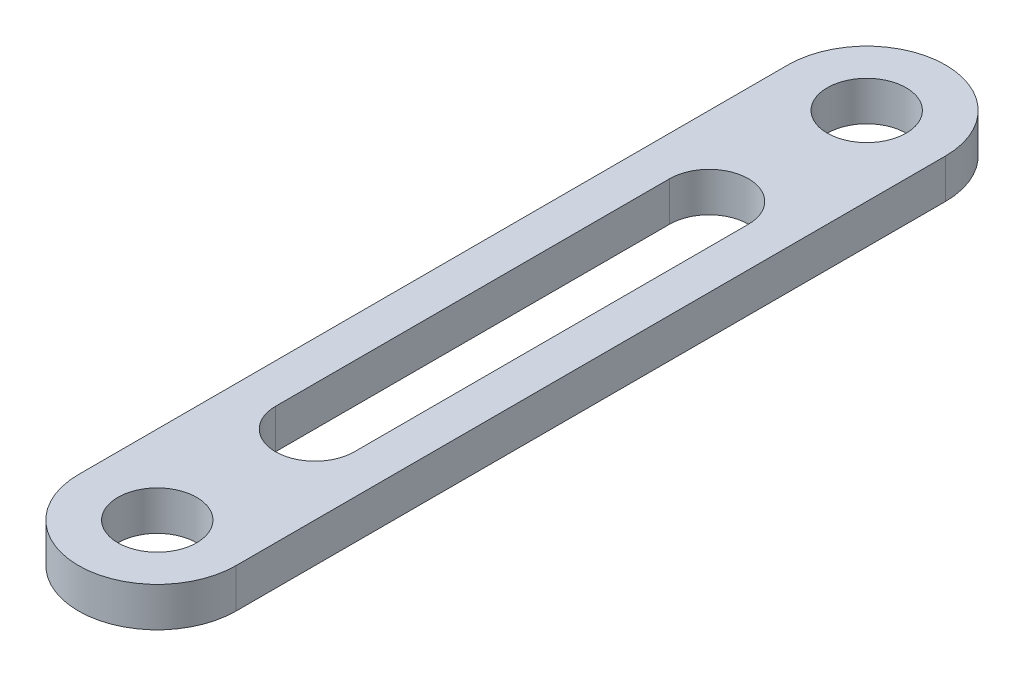
ISO-10303-21;
HEADER;
FILE_DESCRIPTION(('STEP AP214'),'2;1');
FILE_NAME('part.step','',(''),(''),'','','');
FILE_SCHEMA(('AUTOMOTIVE_DESIGN { 1 0 10303 214 1 1 1 1 }'));
ENDSEC;
DATA;
#1=APPLICATION_CONTEXT('core data for automotive mechanical design processes');
#2=APPLICATION_PROTOCOL_DEFINITION('international standard','automotive_design',2000,#1);
#3=PRODUCT_CONTEXT('',#1,'mechanical');
#4=PRODUCT('Part','Part','',(#3));
#5=PRODUCT_RELATED_PRODUCT_CATEGORY('part','',(#4));
#6=PRODUCT_DEFINITION_FORMATION('','',#4);
#7=PRODUCT_DEFINITION_CONTEXT('part definition',#1,'design');
#8=PRODUCT_DEFINITION('design','',#6,#7);
#9=PRODUCT_DEFINITION_SHAPE('','',#8);
#10=(LENGTH_UNIT() NAMED_UNIT(*) SI_UNIT(.MILLI.,.METRE.));
#11=(NAMED_UNIT(*) PLANE_ANGLE_UNIT() SI_UNIT($,.RADIAN.));
#12=(NAMED_UNIT(*) SI_UNIT($,.STERADIAN.) SOLID_ANGLE_UNIT());
#13=UNCERTAINTY_MEASURE_WITH_UNIT(LENGTH_MEASURE(1.E-05),#10,'distance_accuracy_value','');
#14=(GEOMETRIC_REPRESENTATION_CONTEXT(3) GLOBAL_UNCERTAINTY_ASSIGNED_CONTEXT((#13)) GLOBAL_UNIT_ASSIGNED_CONTEXT((#10,
#11,#12)) REPRESENTATION_CONTEXT('',''));
#15=CARTESIAN_POINT('',(0.,0.,0.));
#16=DIRECTION('',(0.,0.,1.));
#17=DIRECTION('',(1.,0.,0.));
#18=AXIS2_PLACEMENT_3D('',#15,#16,#17);
#19=CARTESIAN_POINT('',(0.,5.,0.));
#20=DIRECTION('',(0.,1.,0.));
#21=DIRECTION('',(0.,0.,1.));
#22=AXIS2_PLACEMENT_3D('',#19,#20,#21);
#23=PLANE('',#22);
#24=CARTESIAN_POINT('',(0.,5.,0.));
#25=DIRECTION('',(0.,1.,0.));
#26=DIRECTION('',(0.,0.,1.));
#27=AXIS2_PLACEMENT_3D('',#24,#25,#26);
#28=CIRCLE('',#27,5.);
#29=CARTESIAN_POINT('',(0.,5.,5.));
#30=VERTEX_POINT('',#29);
#31=EDGE_CURVE('E127',#30,#30,#28,.T.);
#32=ORIENTED_EDGE('',*,*,#31,.F.);
#33=EDGE_LOOP('',(#32));
#34=FACE_BOUND('',#33,.T.);
#35=CARTESIAN_POINT('',(0.,5.,0.));
#36=DIRECTION('',(0.,1.,0.));
#37=DIRECTION('',(0.,0.,1.));
#38=AXIS2_PLACEMENT_3D('',#35,#36,#37);
#39=CIRCLE('',#38,10.);
#40=CARTESIAN_POINT('',(10.,5.,0.));
#41=VERTEX_POINT('',#40);
#42=CARTESIAN_POINT('',(-10.,5.,0.));
#43=VERTEX_POINT('',#42);
#44=EDGE_CURVE('E137',#41,#43,#39,.T.);
#45=ORIENTED_EDGE('',*,*,#44,.T.);
#46=DIRECTION('',(0.,0.,1.));
#47=VECTOR('',#46,1.);
#48=CARTESIAN_POINT('',(-10.,5.,0.));
#49=LINE('',#48,#47);
#50=CARTESIAN_POINT('',(-9.99999999999999,5.,90.));
#51=VERTEX_POINT('',#50);
#52=EDGE_CURVE('E140',#43,#51,#49,.T.);
#53=ORIENTED_EDGE('',*,*,#52,.T.);
#54=CARTESIAN_POINT('',(0.,5.,90.));
#55=DIRECTION('',(0.,1.,0.));
#56=DIRECTION('',(0.,0.,1.));
#57=AXIS2_PLACEMENT_3D('',#54,#55,#56);
#58=CIRCLE('',#57,10.);
#59=CARTESIAN_POINT('',(10.,5.,90.));
#60=VERTEX_POINT('',#59);
#61=EDGE_CURVE('E143',#51,#60,#58,.T.);
#62=ORIENTED_EDGE('',*,*,#61,.T.);
#63=DIRECTION('',(0.,0.,-1.));
#64=VECTOR('',#63,1.);
#65=CARTESIAN_POINT('',(10.,5.,0.));
#66=LINE('',#65,#64);
#67=EDGE_CURVE('E145',#60,#41,#66,.T.);
#68=ORIENTED_EDGE('',*,*,#67,.T.);
#69=EDGE_LOOP('',(#45,#53,#62,#68));
#70=FACE_BOUND('',#69,.T.);
#71=DIRECTION('',(0.,0.,1.));
#72=VECTOR('',#71,1.);
#73=CARTESIAN_POINT('',(-5.,5.,20.));
#74=LINE('',#73,#72);
#75=CARTESIAN_POINT('',(-5.,5.,20.));
#76=VERTEX_POINT('',#75);
#77=CARTESIAN_POINT('',(-4.99999999999999,5.,70.));
#78=VERTEX_POINT('',#77);
#79=EDGE_CURVE('E106',#76,#78,#74,.T.);
#80=ORIENTED_EDGE('',*,*,#79,.F.);
#81=CARTESIAN_POINT('',(0.,5.,20.));
#82=DIRECTION('',(0.,1.,0.));
#83=DIRECTION('',(0.,0.,1.));
#84=AXIS2_PLACEMENT_3D('',#81,#82,#83);
#85=CIRCLE('',#84,5.);
#86=CARTESIAN_POINT('',(5.,5.,20.));
#87=VERTEX_POINT('',#86);
#88=EDGE_CURVE('E98',#87,#76,#85,.T.);
#89=ORIENTED_EDGE('',*,*,#88,.F.);
#90=DIRECTION('',(0.,0.,-1.));
#91=VECTOR('',#90,1.);
#92=CARTESIAN_POINT('',(5.,5.,20.));
#93=LINE('',#92,#91);
#94=CARTESIAN_POINT('',(5.00000000000001,5.,70.));
#95=VERTEX_POINT('',#94);
#96=EDGE_CURVE('E121',#95,#87,#93,.T.);
#97=ORIENTED_EDGE('',*,*,#96,.F.);
#98=CARTESIAN_POINT('',(0.,5.,70.));
#99=DIRECTION('',(0.,1.,0.));
#100=DIRECTION('',(0.,0.,1.));
#101=AXIS2_PLACEMENT_3D('',#98,#99,#100);
#102=CIRCLE('',#101,5.);
#103=EDGE_CURVE('E119',#78,#95,#102,.T.);
#104=ORIENTED_EDGE('',*,*,#103,.F.);
#105=EDGE_LOOP('',(#80,#89,#97,#104));
#106=FACE_BOUND('',#105,.T.);
#107=CARTESIAN_POINT('',(0.,5.,90.));
#108=DIRECTION('',(0.,1.,0.));
#109=DIRECTION('',(0.,0.,1.));
#110=AXIS2_PLACEMENT_3D('',#107,#108,#109);
#111=CIRCLE('',#110,5.);
#112=CARTESIAN_POINT('',(0.,5.,95.));
#113=VERTEX_POINT('',#112);
#114=EDGE_CURVE('E227',#113,#113,#111,.T.);
#115=ORIENTED_EDGE('',*,*,#114,.F.);
#116=EDGE_LOOP('',(#115));
#117=FACE_BOUND('',#116,.T.);
#118=ADVANCED_FACE('F33',(#34,#70,#106,#117),#23,.T.);
#119=CARTESIAN_POINT('',(0.,0.,0.));
#120=DIRECTION('',(0.,1.,0.));
#121=DIRECTION('',(0.,0.,1.));
#122=AXIS2_PLACEMENT_3D('',#119,#120,#121);
#123=PLANE('',#122);
#124=CARTESIAN_POINT('',(0.,0.,0.));
#125=DIRECTION('',(0.,1.,0.));
#126=DIRECTION('',(0.,0.,1.));
#127=AXIS2_PLACEMENT_3D('',#124,#125,#126);
#128=CIRCLE('',#127,10.);
#129=CARTESIAN_POINT('',(10.,0.,0.));
#130=VERTEX_POINT('',#129);
#131=CARTESIAN_POINT('',(-10.,0.,0.));
#132=VERTEX_POINT('',#131);
#133=EDGE_CURVE('E114',#130,#132,#128,.T.);
#134=ORIENTED_EDGE('',*,*,#133,.F.);
#135=DIRECTION('',(0.,0.,-1.));
#136=VECTOR('',#135,1.);
#137=CARTESIAN_POINT('',(10.,0.,0.));
#138=LINE('',#137,#136);
#139=CARTESIAN_POINT('',(10.,0.,90.));
#140=VERTEX_POINT('',#139);
#141=EDGE_CURVE('E141',#140,#130,#138,.T.);
#142=ORIENTED_EDGE('',*,*,#141,.F.);
#143=CARTESIAN_POINT('',(0.,0.,90.));
#144=DIRECTION('',(0.,1.,0.));
#145=DIRECTION('',(0.,0.,1.));
#146=AXIS2_PLACEMENT_3D('',#143,#144,#145);
#147=CIRCLE('',#146,10.);
#148=CARTESIAN_POINT('',(-9.99999999999999,0.,90.));
#149=VERTEX_POINT('',#148);
#150=EDGE_CURVE('E152',#149,#140,#147,.T.);
#151=ORIENTED_EDGE('',*,*,#150,.F.);
#152=DIRECTION('',(0.,0.,1.));
#153=VECTOR('',#152,1.);
#154=CARTESIAN_POINT('',(-10.,0.,0.));
#155=LINE('',#154,#153);
#156=EDGE_CURVE('E150',#132,#149,#155,.T.);
#157=ORIENTED_EDGE('',*,*,#156,.F.);
#158=EDGE_LOOP('',(#134,#142,#151,#157));
#159=FACE_BOUND('',#158,.T.);
#160=CARTESIAN_POINT('',(0.,0.,20.));
#161=DIRECTION('',(0.,1.,0.));
#162=DIRECTION('',(0.,0.,1.));
#163=AXIS2_PLACEMENT_3D('',#160,#161,#162);
#164=CIRCLE('',#163,5.);
#165=CARTESIAN_POINT('',(5.,0.,20.));
#166=VERTEX_POINT('',#165);
#167=CARTESIAN_POINT('',(-5.,0.,20.));
#168=VERTEX_POINT('',#167);
#169=EDGE_CURVE('E56',#166,#168,#164,.T.);
#170=ORIENTED_EDGE('',*,*,#169,.T.);
#171=DIRECTION('',(0.,0.,1.));
#172=VECTOR('',#171,1.);
#173=CARTESIAN_POINT('',(-5.,0.,20.));
#174=LINE('',#173,#172);
#175=CARTESIAN_POINT('',(-4.99999999999999,0.,70.));
#176=VERTEX_POINT('',#175);
#177=EDGE_CURVE('E113',#168,#176,#174,.T.);
#178=ORIENTED_EDGE('',*,*,#177,.T.);
#179=CARTESIAN_POINT('',(0.,0.,70.));
#180=DIRECTION('',(0.,1.,0.));
#181=DIRECTION('',(0.,0.,1.));
#182=AXIS2_PLACEMENT_3D('',#179,#180,#181);
#183=CIRCLE('',#182,5.);
#184=CARTESIAN_POINT('',(5.00000000000001,0.,70.));
#185=VERTEX_POINT('',#184);
#186=EDGE_CURVE('E129',#176,#185,#183,.T.);
#187=ORIENTED_EDGE('',*,*,#186,.T.);
#188=DIRECTION('',(0.,0.,-1.));
#189=VECTOR('',#188,1.);
#190=CARTESIAN_POINT('',(5.,0.,20.));
#191=LINE('',#190,#189);
#192=EDGE_CURVE('E107',#185,#166,#191,.T.);
#193=ORIENTED_EDGE('',*,*,#192,.T.);
#194=EDGE_LOOP('',(#170,#178,#187,#193));
#195=FACE_BOUND('',#194,.T.);
#196=CARTESIAN_POINT('',(0.,0.,0.));
#197=DIRECTION('',(0.,1.,0.));
#198=DIRECTION('',(0.,0.,1.));
#199=AXIS2_PLACEMENT_3D('',#196,#197,#198);
#200=CIRCLE('',#199,5.);
#201=CARTESIAN_POINT('',(0.,0.,5.));
#202=VERTEX_POINT('',#201);
#203=EDGE_CURVE('E233',#202,#202,#200,.T.);
#204=ORIENTED_EDGE('',*,*,#203,.T.);
#205=EDGE_LOOP('',(#204));
#206=FACE_BOUND('',#205,.T.);
#207=CARTESIAN_POINT('',(0.,0.,90.));
#208=DIRECTION('',(0.,1.,0.));
#209=DIRECTION('',(0.,0.,1.));
#210=AXIS2_PLACEMENT_3D('',#207,#208,#209);
#211=CIRCLE('',#210,5.);
#212=CARTESIAN_POINT('',(0.,0.,95.));
#213=VERTEX_POINT('',#212);
#214=EDGE_CURVE('E230',#213,#213,#211,.T.);
#215=ORIENTED_EDGE('',*,*,#214,.T.);
#216=EDGE_LOOP('',(#215));
#217=FACE_BOUND('',#216,.T.);
#218=ADVANCED_FACE('F170',(#159,#195,#206,#217),#123,.F.);
#219=CARTESIAN_POINT('',(0.,5.,0.));
#220=DIRECTION('',(0.,-1.,0.));
#221=DIRECTION('',(0.,0.,-1.));
#222=AXIS2_PLACEMENT_3D('',#219,#220,#221);
#223=CYLINDRICAL_SURFACE('',#222,10.);
#224=ORIENTED_EDGE('',*,*,#133,.T.);
#225=DIRECTION('',(0.,-1.,0.));
#226=VECTOR('',#225,1.);
#227=CARTESIAN_POINT('',(-10.,5.,0.));
#228=LINE('',#227,#226);
#229=EDGE_CURVE('E11',#43,#132,#228,.T.);
#230=ORIENTED_EDGE('',*,*,#229,.F.);
#231=ORIENTED_EDGE('',*,*,#44,.F.);
#232=DIRECTION('',(0.,-1.,0.));
#233=VECTOR('',#232,1.);
#234=CARTESIAN_POINT('',(10.,5.,0.));
#235=LINE('',#234,#233);
#236=EDGE_CURVE('E147',#41,#130,#235,.T.);
#237=ORIENTED_EDGE('',*,*,#236,.T.);
#238=EDGE_LOOP('',(#224,#230,#231,#237));
#239=FACE_BOUND('',#238,.T.);
#240=ADVANCED_FACE('F35',(#239),#223,.T.);
#241=CARTESIAN_POINT('',(-10.,5.,0.));
#242=DIRECTION('',(1.,0.,0.));
#243=DIRECTION('',(0.,0.,-1.));
#244=AXIS2_PLACEMENT_3D('',#241,#242,#243);
#245=PLANE('',#244);
#246=ORIENTED_EDGE('',*,*,#156,.T.);
#247=DIRECTION('',(0.,-1.,0.));
#248=VECTOR('',#247,1.);
#249=CARTESIAN_POINT('',(-9.99999999999999,5.,90.));
#250=LINE('',#249,#248);
#251=EDGE_CURVE('E41',#51,#149,#250,.T.);
#252=ORIENTED_EDGE('',*,*,#251,.F.);
#253=ORIENTED_EDGE('',*,*,#52,.F.);
#254=ORIENTED_EDGE('',*,*,#229,.T.);
#255=EDGE_LOOP('',(#246,#252,#253,#254));
#256=FACE_BOUND('',#255,.T.);
#257=ADVANCED_FACE('F180',(#256),#245,.F.);
#258=CARTESIAN_POINT('',(0.,5.,90.));
#259=DIRECTION('',(0.,-1.,0.));
#260=DIRECTION('',(0.,0.,-1.));
#261=AXIS2_PLACEMENT_3D('',#258,#259,#260);
#262=CYLINDRICAL_SURFACE('',#261,10.);
#263=ORIENTED_EDGE('',*,*,#150,.T.);
#264=DIRECTION('',(0.,-1.,0.));
#265=VECTOR('',#264,1.);
#266=CARTESIAN_POINT('',(10.,5.,90.));
#267=LINE('',#266,#265);
#268=EDGE_CURVE('E157',#60,#140,#267,.T.);
#269=ORIENTED_EDGE('',*,*,#268,.F.);
#270=ORIENTED_EDGE('',*,*,#61,.F.);
#271=ORIENTED_EDGE('',*,*,#251,.T.);
#272=EDGE_LOOP('',(#263,#269,#270,#271));
#273=FACE_BOUND('',#272,.T.);
#274=ADVANCED_FACE('F164',(#273),#262,.T.);
#275=CARTESIAN_POINT('',(10.,5.,0.));
#276=DIRECTION('',(-1.,0.,0.));
#277=DIRECTION('',(0.,0.,1.));
#278=AXIS2_PLACEMENT_3D('',#275,#276,#277);
#279=PLANE('',#278);
#280=ORIENTED_EDGE('',*,*,#141,.T.);
#281=ORIENTED_EDGE('',*,*,#236,.F.);
#282=ORIENTED_EDGE('',*,*,#67,.F.);
#283=ORIENTED_EDGE('',*,*,#268,.T.);
#284=EDGE_LOOP('',(#280,#281,#282,#283));
#285=FACE_BOUND('',#284,.T.);
#286=ADVANCED_FACE('F174',(#285),#279,.F.);
#287=CARTESIAN_POINT('',(0.,5.,20.));
#288=DIRECTION('',(0.,-1.,0.));
#289=DIRECTION('',(0.,0.,-1.));
#290=AXIS2_PLACEMENT_3D('',#287,#288,#289);
#291=CYLINDRICAL_SURFACE('',#290,5.);
#292=ORIENTED_EDGE('',*,*,#169,.F.);
#293=DIRECTION('',(0.,-1.,0.));
#294=VECTOR('',#293,1.);
#295=CARTESIAN_POINT('',(5.,5.,20.));
#296=LINE('',#295,#294);
#297=EDGE_CURVE('E102',#87,#166,#296,.T.);
#298=ORIENTED_EDGE('',*,*,#297,.F.);
#299=ORIENTED_EDGE('',*,*,#88,.T.);
#300=DIRECTION('',(0.,-1.,0.));
#301=VECTOR('',#300,1.);
#302=CARTESIAN_POINT('',(-5.,5.,20.));
#303=LINE('',#302,#301);
#304=EDGE_CURVE('E101',#76,#168,#303,.T.);
#305=ORIENTED_EDGE('',*,*,#304,.T.);
#306=EDGE_LOOP('',(#292,#298,#299,#305));
#307=FACE_BOUND('',#306,.T.);
#308=ADVANCED_FACE('F100',(#307),#291,.F.);
#309=CARTESIAN_POINT('',(-5.,5.,20.));
#310=DIRECTION('',(1.,0.,0.));
#311=DIRECTION('',(0.,0.,-1.));
#312=AXIS2_PLACEMENT_3D('',#309,#310,#311);
#313=PLANE('',#312);
#314=ORIENTED_EDGE('',*,*,#177,.F.);
#315=ORIENTED_EDGE('',*,*,#304,.F.);
#316=ORIENTED_EDGE('',*,*,#79,.T.);
#317=DIRECTION('',(0.,-1.,0.));
#318=VECTOR('',#317,1.);
#319=CARTESIAN_POINT('',(-4.99999999999999,5.,70.));
#320=LINE('',#319,#318);
#321=EDGE_CURVE('E115',#78,#176,#320,.T.);
#322=ORIENTED_EDGE('',*,*,#321,.T.);
#323=EDGE_LOOP('',(#314,#315,#316,#322));
#324=FACE_BOUND('',#323,.T.);
#325=ADVANCED_FACE('F110',(#324),#313,.T.);
#326=CARTESIAN_POINT('',(0.,5.,70.));
#327=DIRECTION('',(0.,-1.,0.));
#328=DIRECTION('',(0.,0.,-1.));
#329=AXIS2_PLACEMENT_3D('',#326,#327,#328);
#330=CYLINDRICAL_SURFACE('',#329,5.);
#331=ORIENTED_EDGE('',*,*,#186,.F.);
#332=ORIENTED_EDGE('',*,*,#321,.F.);
#333=ORIENTED_EDGE('',*,*,#103,.T.);
#334=DIRECTION('',(0.,-1.,0.));
#335=VECTOR('',#334,1.);
#336=CARTESIAN_POINT('',(5.00000000000001,5.,70.));
#337=LINE('',#336,#335);
#338=EDGE_CURVE('E48',#95,#185,#337,.T.);
#339=ORIENTED_EDGE('',*,*,#338,.T.);
#340=EDGE_LOOP('',(#331,#332,#333,#339));
#341=FACE_BOUND('',#340,.T.);
#342=ADVANCED_FACE('F205',(#341),#330,.F.);
#343=CARTESIAN_POINT('',(5.,5.,20.));
#344=DIRECTION('',(-1.,0.,0.));
#345=DIRECTION('',(0.,0.,1.));
#346=AXIS2_PLACEMENT_3D('',#343,#344,#345);
#347=PLANE('',#346);
#348=ORIENTED_EDGE('',*,*,#192,.F.);
#349=ORIENTED_EDGE('',*,*,#338,.F.);
#350=ORIENTED_EDGE('',*,*,#96,.T.);
#351=ORIENTED_EDGE('',*,*,#297,.T.);
#352=EDGE_LOOP('',(#348,#349,#350,#351));
#353=FACE_BOUND('',#352,.T.);
#354=ADVANCED_FACE('F209',(#353),#347,.T.);
#355=CARTESIAN_POINT('',(0.,5.,0.));
#356=DIRECTION('',(0.,-1.,0.));
#357=DIRECTION('',(0.,0.,-1.));
#358=AXIS2_PLACEMENT_3D('',#355,#356,#357);
#359=CYLINDRICAL_SURFACE('',#358,5.);
#360=ORIENTED_EDGE('',*,*,#31,.T.);
#361=EDGE_LOOP('',(#360));
#362=FACE_BOUND('',#361,.T.);
#363=ORIENTED_EDGE('',*,*,#203,.F.);
#364=EDGE_LOOP('',(#363));
#365=FACE_BOUND('',#364,.T.);
#366=ADVANCED_FACE('F215',(#362,#365),#359,.F.);
#367=CARTESIAN_POINT('',(0.,5.,90.));
#368=DIRECTION('',(0.,-1.,0.));
#369=DIRECTION('',(0.,0.,-1.));
#370=AXIS2_PLACEMENT_3D('',#367,#368,#369);
#371=CYLINDRICAL_SURFACE('',#370,5.);
#372=ORIENTED_EDGE('',*,*,#114,.T.);
#373=EDGE_LOOP('',(#372));
#374=FACE_BOUND('',#373,.T.);
#375=ORIENTED_EDGE('',*,*,#214,.F.);
#376=EDGE_LOOP('',(#375));
#377=FACE_BOUND('',#376,.T.);
#378=ADVANCED_FACE('F218',(#374,#377),#371,.F.);
#379=CLOSED_SHELL('',(#118,#218,#240,#257,#274,#286,#308,#325,#342,#354,#366,#378));
#380=MANIFOLD_SOLID_BREP('B2',#379);
#381=ADVANCED_BREP_SHAPE_REPRESENTATION('',(#18,#380),#14);
#382=SHAPE_DEFINITION_REPRESENTATION(#9,#381);
ENDSEC;
END-ISO-10303-21;
